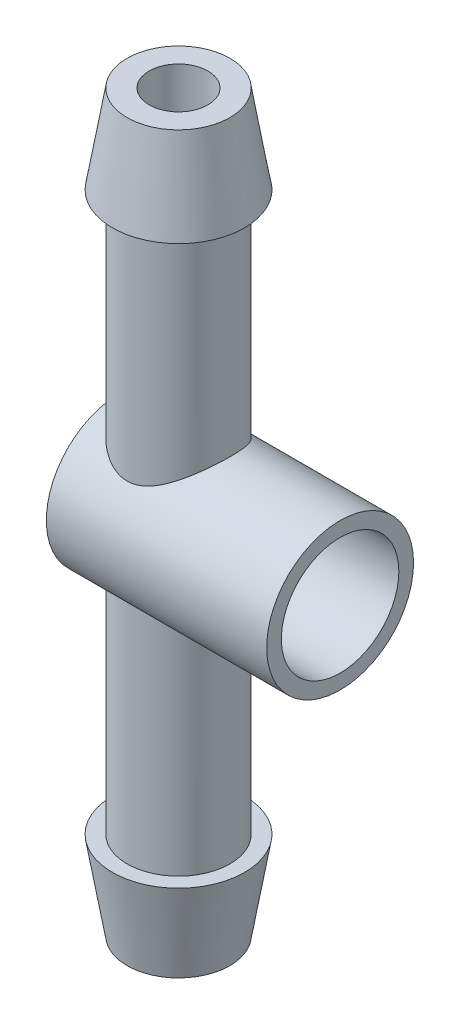
ISO-10303-21;
HEADER;
FILE_DESCRIPTION(('STEP AP214'),'2;1');
FILE_NAME('part.step','',(''),(''),'','','');
FILE_SCHEMA(('AUTOMOTIVE_DESIGN { 1 0 10303 214 1 1 1 1 }'));
ENDSEC;
DATA;
#1=APPLICATION_CONTEXT('core data for automotive mechanical design processes');
#2=APPLICATION_PROTOCOL_DEFINITION('international standard','automotive_design',2000,#1);
#3=PRODUCT_CONTEXT('',#1,'mechanical');
#4=PRODUCT('Part','Part','',(#3));
#5=PRODUCT_RELATED_PRODUCT_CATEGORY('part','',(#4));
#6=PRODUCT_DEFINITION_FORMATION('','',#4);
#7=PRODUCT_DEFINITION_CONTEXT('part definition',#1,'design');
#8=PRODUCT_DEFINITION('design','',#6,#7);
#9=PRODUCT_DEFINITION_SHAPE('','',#8);
#10=(LENGTH_UNIT() NAMED_UNIT(*) SI_UNIT(.MILLI.,.METRE.));
#11=(NAMED_UNIT(*) PLANE_ANGLE_UNIT() SI_UNIT($,.RADIAN.));
#12=(NAMED_UNIT(*) SI_UNIT($,.STERADIAN.) SOLID_ANGLE_UNIT());
#13=UNCERTAINTY_MEASURE_WITH_UNIT(LENGTH_MEASURE(1.E-05),#10,'distance_accuracy_value','');
#14=(GEOMETRIC_REPRESENTATION_CONTEXT(3) GLOBAL_UNCERTAINTY_ASSIGNED_CONTEXT((#13)) GLOBAL_UNIT_ASSIGNED_CONTEXT((#10,
#11,#12)) REPRESENTATION_CONTEXT('',''));
#15=CARTESIAN_POINT('',(0.,0.,0.));
#16=DIRECTION('',(0.,0.,1.));
#17=DIRECTION('',(1.,0.,0.));
#18=AXIS2_PLACEMENT_3D('',#15,#16,#17);
#19=CARTESIAN_POINT('',(0.,0.,0.));
#20=DIRECTION('',(0.,-1.,0.));
#21=DIRECTION('',(0.,0.,-1.));
#22=AXIS2_PLACEMENT_3D('',#19,#20,#21);
#23=CYLINDRICAL_SURFACE('',#22,3.5);
#24=CARTESIAN_POINT('',(0.,19.,0.));
#25=DIRECTION('',(0.,-1.,0.));
#26=DIRECTION('',(0.,0.,-1.));
#27=AXIS2_PLACEMENT_3D('',#24,#25,#26);
#28=CIRCLE('',#27,3.5);
#29=CARTESIAN_POINT('',(0.,19.,-3.5));
#30=VERTEX_POINT('',#29);
#31=EDGE_CURVE('E97',#30,#30,#28,.T.);
#32=ORIENTED_EDGE('',*,*,#31,.T.);
#33=EDGE_LOOP('',(#32));
#34=FACE_BOUND('',#33,.T.);
#35=CARTESIAN_POINT('',(0.,3.57071421427142,-3.5));
#36=CARTESIAN_POINT('',(0.0840116779324864,3.57071444227762,-3.49999986805821));
#37=CARTESIAN_POINT('',(0.168028079140196,3.57369340485415,-3.49696837280135));
#38=CARTESIAN_POINT('',(0.335221129012422,3.58544479584589,-3.48491820858272));
#39=CARTESIAN_POINT('',(0.418397669630142,3.59421796027333,-3.47589877899899));
#40=CARTESIAN_POINT('',(0.583301238778193,3.61712038134413,-3.45205902368666));
#41=CARTESIAN_POINT('',(0.665025625456488,3.63125852486516,-3.43722907172256));
#42=CARTESIAN_POINT('',(0.826329023076986,3.66422903125624,-3.4020589996042));
#43=CARTESIAN_POINT('',(0.905906844242423,3.68306394047143,-3.38171588997806));
#44=CARTESIAN_POINT('',(1.13891610777643,3.74498377926853,-3.31343273469923));
#45=CARTESIAN_POINT('',(1.28866920309647,3.79380187047573,-3.25792983356845));
#46=CARTESIAN_POINT('',(1.5762979964841,3.90087401896263,-3.12892878038648));
#47=CARTESIAN_POINT('',(1.71417286646821,3.95912873329683,-3.05542937508973));
#48=CARTESIAN_POINT('',(2.00068057857175,4.09069829259001,-2.8775800199573));
#49=CARTESIAN_POINT('',(2.14696903211522,4.1648639532264,-2.77008151456322));
#50=CARTESIAN_POINT('',(2.42158246330334,4.31285170621027,-2.533533970982));
#51=CARTESIAN_POINT('',(2.54988496335192,4.38667325913045,-2.40445840102965));
#52=CARTESIAN_POINT('',(2.73702564724301,4.49869833464921,-2.18404386347787));
#53=CARTESIAN_POINT('',(2.80255801089666,4.53894407009186,-2.09934275905102));
#54=CARTESIAN_POINT('',(2.92615122230603,4.61627900113461,-1.92332930388745));
#55=CARTESIAN_POINT('',(2.98421543282749,4.65336961485967,-1.8320199578628));
#56=CARTESIAN_POINT('',(3.09214650586378,4.72331286900139,-1.64329666492626));
#57=CARTESIAN_POINT('',(3.14202401534737,4.75617100167412,-1.5458908781143));
#58=CARTESIAN_POINT('',(3.23289758065904,4.81668778515884,-1.34554036564389));
#59=CARTESIAN_POINT('',(3.27389750364978,4.8443486992323,-1.24259807623482));
#60=CARTESIAN_POINT('',(3.36294664968771,4.90488399105479,-0.983360292526845));
#61=CARTESIAN_POINT('',(3.40555834349915,4.9343004623269,-0.82431114751619));
#62=CARTESIAN_POINT('',(3.46805516224507,4.97763994451799,-0.499863083697432));
#63=CARTESIAN_POINT('',(3.4879584332919,4.9915753260128,-0.334469344205599));
#64=CARTESIAN_POINT('',(3.50396874819295,5.00277536324989,-0.00161744745794356));
#65=CARTESIAN_POINT('',(3.50002957617995,5.00000764195533,0.165844090878665));
#66=CARTESIAN_POINT('',(3.46847694384495,4.9779722699754,0.497418219515082));
#67=CARTESIAN_POINT('',(3.44085688171562,4.95870001812474,0.661529862861085));
#68=CARTESIAN_POINT('',(3.36438776537339,4.90595172527039,0.978182973341564));
#69=CARTESIAN_POINT('',(3.3160375128713,4.87280983262962,1.13090300544785));
#70=CARTESIAN_POINT('',(3.20037374324192,4.79484839778882,1.42573235226602));
#71=CARTESIAN_POINT('',(3.13305650077699,4.75002656164199,1.56783957555516));
#72=CARTESIAN_POINT('',(2.97319649241973,4.64605138757534,1.85472986503378));
#73=CARTESIAN_POINT('',(2.87867047586743,4.58585414417232,1.9980230608955));
#74=CARTESIAN_POINT('',(2.67150358308888,4.45872611615666,2.26760327144735));
#75=CARTESIAN_POINT('',(2.55884319710731,4.39178810890111,2.39387169821936));
#76=CARTESIAN_POINT('',(2.29573767251103,4.24340806485979,2.64933768852684));
#77=CARTESIAN_POINT('',(2.14213778990544,4.16151070369986,2.7750310967952));
#78=CARTESIAN_POINT('',(1.8141470616634,4.00256853562557,2.9997251914824));
#79=CARTESIAN_POINT('',(1.639761605166,3.92552247878181,3.09873277519884));
#80=CARTESIAN_POINT('',(1.31428904519063,3.80266209132211,3.24758768225954));
#81=CARTESIAN_POINT('',(1.16716049925933,3.75374718450966,3.30350993621508));
#82=CARTESIAN_POINT('',(0.862869886422324,3.67060616067577,3.39566741502561));
#83=CARTESIAN_POINT('',(0.70572720470501,3.63635259865795,3.4319394578135));
#84=CARTESIAN_POINT('',(0.464387907698291,3.59988592145285,3.47003079615615));
#85=CARTESIAN_POINT('',(0.382521787369572,3.59020430967993,3.48001777086798));
#86=CARTESIAN_POINT('',(0.217838512660768,3.57641501090518,3.49418953353764));
#87=CARTESIAN_POINT('',(0.135021855389569,3.57230453329973,3.49837722640208));
#88=CARTESIAN_POINT('',(-0.030779718824703,3.56988465651078,3.50084655748581));
#89=CARTESIAN_POINT('',(-0.11376462434785,3.57157487596197,3.49912858397159));
#90=CARTESIAN_POINT('',(-0.279068232542991,3.5806497895567,3.48984003419737));
#91=CARTESIAN_POINT('',(-0.361386963190148,3.58803424331106,3.48226970500183));
#92=CARTESIAN_POINT('',(-0.583474178939261,3.61539718295496,3.4539187383549));
#93=CARTESIAN_POINT('',(-0.721933700488153,3.64061523125558,3.42755118460911));
#94=CARTESIAN_POINT('',(-0.991952802032504,3.70359382721181,3.35939166417161));
#95=CARTESIAN_POINT('',(-1.12350493994883,3.74136759395142,3.31758343584067));
#96=CARTESIAN_POINT('',(-1.43844585408463,3.84548595331839,3.19705702205981));
#97=CARTESIAN_POINT('',(-1.61706048647181,3.91690709544712,3.11022921638748));
#98=CARTESIAN_POINT('',(-1.95485779131787,4.0679911437822,2.90985386221773));
#99=CARTESIAN_POINT('',(-2.11400154770159,4.14766998612658,2.79625408887282));
#100=CARTESIAN_POINT('',(-2.4142081576382,4.30837399504844,2.54184750044465));
#101=CARTESIAN_POINT('',(-2.5548731096704,4.38939619169587,2.40056769357133));
#102=CARTESIAN_POINT('',(-2.81172054695841,4.54370670629866,2.09383690527273));
#103=CARTESIAN_POINT('',(-2.92793893053597,4.61700628432375,1.92842197842841));
#104=CARTESIAN_POINT('',(-3.11554550187088,4.73839524822716,1.60391474590199));
#105=CARTESIAN_POINT('',(-3.19113943423207,4.78864360221706,1.44809589803303));
#106=CARTESIAN_POINT('',(-3.28724745450784,4.85339532505929,1.20483682926395));
#107=CARTESIAN_POINT('',(-3.31640852374087,4.87321301651713,1.12213837140326));
#108=CARTESIAN_POINT('',(-3.36861764851274,4.90889181456439,0.95401795353754));
#109=CARTESIAN_POINT('',(-3.39166831580516,4.92475461141138,0.868597174673483));
#110=CARTESIAN_POINT('',(-3.43145562806069,4.95223988843494,0.695045998305564));
#111=CARTESIAN_POINT('',(-3.44815166702544,4.96383508366238,0.606901942141645));
#112=CARTESIAN_POINT('',(-3.47475258567891,4.98235028019359,0.429146661764379));
#113=CARTESIAN_POINT('',(-3.48466051684761,4.98927238218753,0.339536115360911));
#114=CARTESIAN_POINT('',(-3.49752312855461,4.99826427408952,0.159574638531939));
#115=CARTESIAN_POINT('',(-3.50047838058363,5.00033446281117,0.0692237695715355));
#116=CARTESIAN_POINT('',(-3.49939464155673,4.99957665306816,-0.111386213674409));
#117=CARTESIAN_POINT('',(-3.49535617592889,4.99674902256968,-0.201645334343126));
#118=CARTESIAN_POINT('',(-3.47427171948632,4.98201193742932,-0.453706070640127));
#119=CARTESIAN_POINT('',(-3.44937301889705,4.96462490953326,-0.614624206362604));
#120=CARTESIAN_POINT('',(-3.37825020758882,4.91547827454332,-0.929254385269863));
#121=CARTESIAN_POINT('',(-3.33202204004973,4.88371593331678,-1.08296505147947));
#122=CARTESIAN_POINT('',(-3.21839303684594,4.80689474829355,-1.3852515294605));
#123=CARTESIAN_POINT('',(-3.15030758175346,4.76140930888083,-1.53345914358804));
#124=CARTESIAN_POINT('',(-2.99606380975609,4.6607922006303,-1.81648395037296));
#125=CARTESIAN_POINT('',(-2.90990199689336,4.60565866619876,-1.9512985453851));
#126=CARTESIAN_POINT('',(-2.70695427970237,4.47998570352176,-2.22620599551136));
#127=CARTESIAN_POINT('',(-2.58748644184947,4.40838537577144,-2.36382741622437));
#128=CARTESIAN_POINT('',(-2.32945012816812,4.26203935440107,-2.61851490693396));
#129=CARTESIAN_POINT('',(-2.19084193301166,4.18728735064932,-2.73553705055278));
#130=CARTESIAN_POINT('',(-1.95826810861001,4.07177790192352,-2.90279164002683));
#131=CARTESIAN_POINT('',(-1.87006627480007,4.02995435750541,-2.96040527554756));
#132=CARTESIAN_POINT('',(-1.68799665355905,3.94875555037811,-3.06787708455973));
#133=CARTESIAN_POINT('',(-1.59412727898289,3.90938097980844,-3.11773307147625));
#134=CARTESIAN_POINT('',(-1.30472529929834,3.79747094334634,-3.25469370743702));
#135=CARTESIAN_POINT('',(-1.10068833748911,3.73077213202405,-3.32970789539528));
#136=CARTESIAN_POINT('',(-0.745417198827448,3.64508796183998,-3.42286407941504));
#137=CARTESIAN_POINT('',(-0.599023314935424,3.61761863156992,-3.45160892505021));
#138=CARTESIAN_POINT('',(-0.376071880715412,3.58970095616241,-3.48054616594461));
#139=CARTESIAN_POINT('',(-0.301217998367208,3.58260959032748,-3.48782851362814));
#140=CARTESIAN_POINT('',(-0.150910559292508,3.57311680421739,-3.49755478092014));
#141=CARTESIAN_POINT('',(-0.075457184822403,3.57071400948196,-3.50000011850681));
#142=CARTESIAN_POINT('',(0.,3.57071421427142,-3.5));
#143=B_SPLINE_CURVE_WITH_KNOTS('',3,(#35,#36,#37,#38,#39,#40,#41,#42,#43,#44,#45,#46,#47,#48,
#49,#50,#51,#52,#53,#54,#55,#56,#57,#58,#59,#60,#61,#62,#63,#64,#65,#66,#67,#68,#69,#70,#71,#72,
#73,#74,#75,#76,#77,#78,#79,#80,#81,#82,#83,#84,#85,#86,#87,#88,#89,#90,#91,#92,#93,#94,#95,#96,
#97,#98,#99,#100,#101,#102,#103,#104,#105,#106,#107,#108,#109,#110,#111,#112,#113,#114,#115,
#116,#117,#118,#119,#120,#121,#122,#123,#124,#125,#126,#127,#128,#129,#130,#131,#132,#133,#134,
#135,#136,#137,#138,#139,#140,#141,#142),.UNSPECIFIED.,.T.,.F.,(4,2,2,2,2,2,2,2,2,2,2,2,2,2,2,2,
2,2,2,2,2,2,2,2,2,2,2,2,2,2,2,2,2,2,2,2,2,2,2,2,2,2,2,2,2,2,2,2,2,2,2,2,2,4),(0.,
0.25193786641243,0.503907741551042,0.756296829862754,1.00882304920269,1.50767705491856,
2.00656580985309,2.5928214793311,3.17980340054548,3.52260937165968,3.86526043937807,
4.20746228977043,4.54951477248526,5.04896295082257,5.54801174411968,6.04802819620321,
6.54818408924557,7.03692702754728,7.52576602764989,8.06947174934062,8.61376637205,
9.25526677268928,9.89660120988578,10.3893951008704,10.8812624388974,11.1300434938738,
11.3786998873025,11.6273399331954,11.8759694830138,12.303607248783,12.7316966796847,
13.3614491436806,13.9924404037767,14.6353397124454,15.2772882678786,15.8158328001981,
16.0852507072975,16.3545532714235,16.6255488849345,16.8964225968411,17.1672740429107,
17.4381051411785,17.9269002736073,18.4157884121986,18.9217932383026,19.4278960158289,
20.0131431134067,20.5996234731159,20.939266740836,21.2790055678481,21.9556531766709,
22.4086307865933,22.6349814326881,22.8612657138439),.UNSPECIFIED.);
#144=CARTESIAN_POINT('',(0.,3.57071421427142,-3.5));
#145=VERTEX_POINT('',#144);
#146=EDGE_CURVE('E10',#145,#145,#143,.T.);
#147=ORIENTED_EDGE('',*,*,#146,.F.);
#148=EDGE_LOOP('',(#147));
#149=FACE_BOUND('',#148,.T.);
#150=ADVANCED_FACE('F33',(#34,#149),#23,.T.);
#151=CARTESIAN_POINT('',(0.,19.,0.));
#152=DIRECTION('',(0.,1.,0.));
#153=DIRECTION('',(0.,0.,1.));
#154=AXIS2_PLACEMENT_3D('',#151,#152,#153);
#155=PLANE('',#154);
#156=ORIENTED_EDGE('',*,*,#31,.F.);
#157=EDGE_LOOP('',(#156));
#158=FACE_BOUND('',#157,.T.);
#159=CARTESIAN_POINT('',(0.,19.,0.));
#160=DIRECTION('',(0.,-1.,0.));
#161=DIRECTION('',(0.,0.,-1.));
#162=AXIS2_PLACEMENT_3D('',#159,#160,#161);
#163=CIRCLE('',#162,4.5);
#164=CARTESIAN_POINT('',(0.,19.,-4.5));
#165=VERTEX_POINT('',#164);
#166=EDGE_CURVE('E100',#165,#165,#163,.T.);
#167=ORIENTED_EDGE('',*,*,#166,.T.);
#168=EDGE_LOOP('',(#167));
#169=FACE_BOUND('',#168,.T.);
#170=ADVANCED_FACE('F85',(#158,#169),#155,.F.);
#171=CARTESIAN_POINT('',(0.,25.,0.));
#172=DIRECTION('',(0.,-1.,0.));
#173=DIRECTION('',(0.,0.,-1.));
#174=AXIS2_PLACEMENT_3D('',#171,#172,#173);
#175=CONICAL_SURFACE('',#174,3.5,0.165148677414627);
#176=ORIENTED_EDGE('',*,*,#166,.F.);
#177=EDGE_LOOP('',(#176));
#178=FACE_BOUND('',#177,.T.);
#179=CARTESIAN_POINT('',(0.,25.,0.));
#180=DIRECTION('',(0.,-1.,0.));
#181=DIRECTION('',(0.,0.,-1.));
#182=AXIS2_PLACEMENT_3D('',#179,#180,#181);
#183=CIRCLE('',#182,3.5);
#184=CARTESIAN_POINT('',(0.,25.,-3.5));
#185=VERTEX_POINT('',#184);
#186=EDGE_CURVE('E101',#185,#185,#183,.T.);
#187=ORIENTED_EDGE('',*,*,#186,.T.);
#188=EDGE_LOOP('',(#187));
#189=FACE_BOUND('',#188,.T.);
#190=ADVANCED_FACE('F82',(#178,#189),#175,.T.);
#191=CARTESIAN_POINT('',(0.,25.,0.));
#192=DIRECTION('',(0.,-1.,0.));
#193=DIRECTION('',(0.,0.,-1.));
#194=AXIS2_PLACEMENT_3D('',#191,#192,#193);
#195=PLANE('',#194);
#196=CARTESIAN_POINT('',(0.,25.,0.));
#197=DIRECTION('',(0.,-1.,0.));
#198=DIRECTION('',(0.,0.,-1.));
#199=AXIS2_PLACEMENT_3D('',#196,#197,#198);
#200=CIRCLE('',#199,2.);
#201=CARTESIAN_POINT('',(0.,25.,-2.));
#202=VERTEX_POINT('',#201);
#203=EDGE_CURVE('E138',#202,#202,#200,.F.);
#204=ORIENTED_EDGE('',*,*,#203,.F.);
#205=EDGE_LOOP('',(#204));
#206=FACE_BOUND('',#205,.T.);
#207=ORIENTED_EDGE('',*,*,#186,.F.);
#208=EDGE_LOOP('',(#207));
#209=FACE_BOUND('',#208,.T.);
#210=ADVANCED_FACE('F75',(#206,#209),#195,.F.);
#211=CARTESIAN_POINT('',(11.,0.,0.));
#212=DIRECTION('',(-1.,0.,0.));
#213=DIRECTION('',(0.,0.,1.));
#214=AXIS2_PLACEMENT_3D('',#211,#212,#213);
#215=CYLINDRICAL_SURFACE('',#214,5.);
#216=CARTESIAN_POINT('',(0.,-3.57071421427142,-3.5));
#217=CARTESIAN_POINT('',(-0.0840116779324864,-3.57071444227762,-3.49999986805821));
#218=CARTESIAN_POINT('',(-0.168028079140196,-3.57369340485415,-3.49696837280135));
#219=CARTESIAN_POINT('',(-0.335221129012422,-3.58544479584589,-3.48491820858272));
#220=CARTESIAN_POINT('',(-0.418397669630142,-3.59421796027333,-3.47589877899899));
#221=CARTESIAN_POINT('',(-0.583301238778193,-3.61712038134413,-3.45205902368666));
#222=CARTESIAN_POINT('',(-0.665025625456488,-3.63125852486516,-3.43722907172256));
#223=CARTESIAN_POINT('',(-0.826329023076986,-3.66422903125624,-3.4020589996042));
#224=CARTESIAN_POINT('',(-0.905906844242423,-3.68306394047143,-3.38171588997806));
#225=CARTESIAN_POINT('',(-1.13891610777643,-3.74498377926853,-3.31343273469923));
#226=CARTESIAN_POINT('',(-1.28866920309647,-3.79380187047573,-3.25792983356845));
#227=CARTESIAN_POINT('',(-1.5762979964841,-3.90087401896263,-3.12892878038648));
#228=CARTESIAN_POINT('',(-1.71417286646821,-3.95912873329683,-3.05542937508973));
#229=CARTESIAN_POINT('',(-2.00068057857175,-4.09069829259001,-2.8775800199573));
#230=CARTESIAN_POINT('',(-2.14696903211522,-4.1648639532264,-2.77008151456322));
#231=CARTESIAN_POINT('',(-2.42158246330334,-4.31285170621027,-2.533533970982));
#232=CARTESIAN_POINT('',(-2.54988496335192,-4.38667325913045,-2.40445840102965));
#233=CARTESIAN_POINT('',(-2.73702564724301,-4.49869833464921,-2.18404386347787));
#234=CARTESIAN_POINT('',(-2.80255801089666,-4.53894407009186,-2.09934275905102));
#235=CARTESIAN_POINT('',(-2.92615122230603,-4.61627900113461,-1.92332930388745));
#236=CARTESIAN_POINT('',(-2.98421543282749,-4.65336961485967,-1.8320199578628));
#237=CARTESIAN_POINT('',(-3.09214650586378,-4.72331286900139,-1.64329666492626));
#238=CARTESIAN_POINT('',(-3.14202401534737,-4.75617100167412,-1.5458908781143));
#239=CARTESIAN_POINT('',(-3.23289758065904,-4.81668778515884,-1.34554036564389));
#240=CARTESIAN_POINT('',(-3.27389750364978,-4.8443486992323,-1.24259807623482));
#241=CARTESIAN_POINT('',(-3.36294664968771,-4.90488399105479,-0.983360292526845));
#242=CARTESIAN_POINT('',(-3.40555834349915,-4.9343004623269,-0.82431114751619));
#243=CARTESIAN_POINT('',(-3.46805516224507,-4.97763994451799,-0.499863083697432));
#244=CARTESIAN_POINT('',(-3.4879584332919,-4.9915753260128,-0.334469344205599));
#245=CARTESIAN_POINT('',(-3.50396874819295,-5.00277536324989,-0.00161744745794356));
#246=CARTESIAN_POINT('',(-3.50002957617995,-5.00000764195533,0.165844090878665));
#247=CARTESIAN_POINT('',(-3.46847694384495,-4.9779722699754,0.497418219515082));
#248=CARTESIAN_POINT('',(-3.44085688171562,-4.95870001812474,0.661529862861085));
#249=CARTESIAN_POINT('',(-3.36438776537339,-4.90595172527039,0.978182973341564));
#250=CARTESIAN_POINT('',(-3.3160375128713,-4.87280983262962,1.13090300544785));
#251=CARTESIAN_POINT('',(-3.20037374324192,-4.79484839778882,1.42573235226602));
#252=CARTESIAN_POINT('',(-3.13305650077699,-4.75002656164199,1.56783957555516));
#253=CARTESIAN_POINT('',(-2.97319649241973,-4.64605138757534,1.85472986503378));
#254=CARTESIAN_POINT('',(-2.87867047586743,-4.58585414417232,1.9980230608955));
#255=CARTESIAN_POINT('',(-2.67150358308888,-4.45872611615666,2.26760327144735));
#256=CARTESIAN_POINT('',(-2.55884319710731,-4.39178810890111,2.39387169821936));
#257=CARTESIAN_POINT('',(-2.29573767251103,-4.24340806485979,2.64933768852684));
#258=CARTESIAN_POINT('',(-2.14213778990544,-4.16151070369986,2.7750310967952));
#259=CARTESIAN_POINT('',(-1.8141470616634,-4.00256853562557,2.9997251914824));
#260=CARTESIAN_POINT('',(-1.639761605166,-3.92552247878181,3.09873277519884));
#261=CARTESIAN_POINT('',(-1.31428904519063,-3.80266209132211,3.24758768225954));
#262=CARTESIAN_POINT('',(-1.16716049925933,-3.75374718450966,3.30350993621508));
#263=CARTESIAN_POINT('',(-0.862869886422324,-3.67060616067577,3.39566741502561));
#264=CARTESIAN_POINT('',(-0.70572720470501,-3.63635259865795,3.4319394578135));
#265=CARTESIAN_POINT('',(-0.464387907698291,-3.59988592145285,3.47003079615615));
#266=CARTESIAN_POINT('',(-0.382521787369572,-3.59020430967993,3.48001777086798));
#267=CARTESIAN_POINT('',(-0.217838512660768,-3.57641501090518,3.49418953353764));
#268=CARTESIAN_POINT('',(-0.135021855389569,-3.57230453329973,3.49837722640208));
#269=CARTESIAN_POINT('',(0.030779718824703,-3.56988465651078,3.50084655748581));
#270=CARTESIAN_POINT('',(0.11376462434785,-3.57157487596197,3.49912858397159));
#271=CARTESIAN_POINT('',(0.279068232542991,-3.5806497895567,3.48984003419737));
#272=CARTESIAN_POINT('',(0.361386963190148,-3.58803424331106,3.48226970500183));
#273=CARTESIAN_POINT('',(0.583474178939261,-3.61539718295496,3.4539187383549));
#274=CARTESIAN_POINT('',(0.721933700488153,-3.64061523125558,3.42755118460911));
#275=CARTESIAN_POINT('',(0.991952802032504,-3.70359382721181,3.35939166417161));
#276=CARTESIAN_POINT('',(1.12350493994883,-3.74136759395142,3.31758343584067));
#277=CARTESIAN_POINT('',(1.43844585408463,-3.84548595331839,3.19705702205981));
#278=CARTESIAN_POINT('',(1.61706048647181,-3.91690709544712,3.11022921638748));
#279=CARTESIAN_POINT('',(1.95485779131787,-4.0679911437822,2.90985386221773));
#280=CARTESIAN_POINT('',(2.11400154770159,-4.14766998612658,2.79625408887282));
#281=CARTESIAN_POINT('',(2.4142081576382,-4.30837399504844,2.54184750044465));
#282=CARTESIAN_POINT('',(2.5548731096704,-4.38939619169587,2.40056769357133));
#283=CARTESIAN_POINT('',(2.81172054695841,-4.54370670629866,2.09383690527273));
#284=CARTESIAN_POINT('',(2.92793893053597,-4.61700628432375,1.92842197842841));
#285=CARTESIAN_POINT('',(3.11554550187088,-4.73839524822716,1.60391474590199));
#286=CARTESIAN_POINT('',(3.19113943423207,-4.78864360221706,1.44809589803303));
#287=CARTESIAN_POINT('',(3.28724745450784,-4.85339532505929,1.20483682926395));
#288=CARTESIAN_POINT('',(3.31640852374087,-4.87321301651713,1.12213837140326));
#289=CARTESIAN_POINT('',(3.36861764851274,-4.90889181456439,0.95401795353754));
#290=CARTESIAN_POINT('',(3.39166831580516,-4.92475461141138,0.868597174673483));
#291=CARTESIAN_POINT('',(3.43145562806069,-4.95223988843494,0.695045998305564));
#292=CARTESIAN_POINT('',(3.44815166702544,-4.96383508366238,0.606901942141645));
#293=CARTESIAN_POINT('',(3.47475258567891,-4.98235028019359,0.429146661764379));
#294=CARTESIAN_POINT('',(3.48466051684761,-4.98927238218753,0.339536115360911));
#295=CARTESIAN_POINT('',(3.49752312855461,-4.99826427408952,0.159574638531939));
#296=CARTESIAN_POINT('',(3.50047838058363,-5.00033446281117,0.0692237695715355));
#297=CARTESIAN_POINT('',(3.49939464155673,-4.99957665306816,-0.111386213674409));
#298=CARTESIAN_POINT('',(3.49535617592889,-4.99674902256968,-0.201645334343126));
#299=CARTESIAN_POINT('',(3.47427171948632,-4.98201193742932,-0.453706070640127));
#300=CARTESIAN_POINT('',(3.44937301889705,-4.96462490953326,-0.614624206362604));
#301=CARTESIAN_POINT('',(3.37825020758882,-4.91547827454332,-0.929254385269863));
#302=CARTESIAN_POINT('',(3.33202204004973,-4.88371593331678,-1.08296505147947));
#303=CARTESIAN_POINT('',(3.21839303684594,-4.80689474829355,-1.3852515294605));
#304=CARTESIAN_POINT('',(3.15030758175346,-4.76140930888083,-1.53345914358804));
#305=CARTESIAN_POINT('',(2.99606380975609,-4.6607922006303,-1.81648395037296));
#306=CARTESIAN_POINT('',(2.90990199689336,-4.60565866619876,-1.9512985453851));
#307=CARTESIAN_POINT('',(2.70695427970237,-4.47998570352176,-2.22620599551136));
#308=CARTESIAN_POINT('',(2.58748644184947,-4.40838537577144,-2.36382741622437));
#309=CARTESIAN_POINT('',(2.32945012816812,-4.26203935440107,-2.61851490693396));
#310=CARTESIAN_POINT('',(2.19084193301166,-4.18728735064932,-2.73553705055278));
#311=CARTESIAN_POINT('',(1.95826810861001,-4.07177790192352,-2.90279164002683));
#312=CARTESIAN_POINT('',(1.87006627480007,-4.02995435750541,-2.96040527554756));
#313=CARTESIAN_POINT('',(1.68799665355905,-3.94875555037811,-3.06787708455973));
#314=CARTESIAN_POINT('',(1.59412727898289,-3.90938097980844,-3.11773307147625));
#315=CARTESIAN_POINT('',(1.30472529929834,-3.79747094334634,-3.25469370743702));
#316=CARTESIAN_POINT('',(1.10068833748911,-3.73077213202405,-3.32970789539528));
#317=CARTESIAN_POINT('',(0.745417198827448,-3.64508796183998,-3.42286407941504));
#318=CARTESIAN_POINT('',(0.599023314935424,-3.61761863156992,-3.45160892505021));
#319=CARTESIAN_POINT('',(0.376071880715412,-3.58970095616241,-3.48054616594461));
#320=CARTESIAN_POINT('',(0.301217998367208,-3.58260959032748,-3.48782851362814));
#321=CARTESIAN_POINT('',(0.150910559292508,-3.57311680421739,-3.49755478092014));
#322=CARTESIAN_POINT('',(0.075457184822403,-3.57071400948196,-3.50000011850681));
#323=CARTESIAN_POINT('',(0.,-3.57071421427142,-3.5));
#324=B_SPLINE_CURVE_WITH_KNOTS('',3,(#216,#217,#218,#219,#220,#221,#222,#223,#224,#225,#226,
#227,#228,#229,#230,#231,#232,#233,#234,#235,#236,#237,#238,#239,#240,#241,#242,#243,#244,#245,
#246,#247,#248,#249,#250,#251,#252,#253,#254,#255,#256,#257,#258,#259,#260,#261,#262,#263,#264,
#265,#266,#267,#268,#269,#270,#271,#272,#273,#274,#275,#276,#277,#278,#279,#280,#281,#282,#283,
#284,#285,#286,#287,#288,#289,#290,#291,#292,#293,#294,#295,#296,#297,#298,#299,#300,#301,#302,
#303,#304,#305,#306,#307,#308,#309,#310,#311,#312,#313,#314,#315,#316,#317,#318,#319,#320,#321,
#322,#323),.UNSPECIFIED.,.T.,.F.,(4,2,2,2,2,2,2,2,2,2,2,2,2,2,2,2,2,2,2,2,2,2,2,2,2,2,2,2,2,2,2,
2,2,2,2,2,2,2,2,2,2,2,2,2,2,2,2,2,2,2,2,2,2,4),(0.,0.25193786641243,0.503907741551042,
0.756296829862754,1.00882304920269,1.50767705491856,2.00656580985309,2.5928214793311,
3.17980340054548,3.52260937165968,3.86526043937807,4.20746228977043,4.54951477248526,
5.04896295082257,5.54801174411968,6.04802819620321,6.54818408924557,7.03692702754728,
7.52576602764989,8.06947174934062,8.61376637205,9.25526677268928,9.89660120988578,
10.3893951008704,10.8812624388974,11.1300434938738,11.3786998873025,11.6273399331954,
11.8759694830138,12.303607248783,12.7316966796847,13.3614491436806,13.9924404037767,
14.6353397124454,15.2772882678786,15.8158328001981,16.0852507072975,16.3545532714235,
16.6255488849345,16.8964225968411,17.1672740429107,17.4381051411785,17.9269002736073,
18.4157884121986,18.9217932383026,19.4278960158289,20.0131431134067,20.5996234731159,
20.939266740836,21.2790055678481,21.9556531766709,22.4086307865933,22.6349814326881,
22.8612657138439),.UNSPECIFIED.);
#325=CARTESIAN_POINT('',(0.,-3.57071421427142,-3.5));
#326=VERTEX_POINT('',#325);
#327=EDGE_CURVE('E46',#326,#326,#324,.T.);
#328=ORIENTED_EDGE('',*,*,#327,.T.);
#329=EDGE_LOOP('',(#328));
#330=FACE_BOUND('',#329,.T.);
#331=CARTESIAN_POINT('',(11.,0.,0.));
#332=DIRECTION('',(1.,0.,0.));
#333=DIRECTION('',(0.,0.,-1.));
#334=AXIS2_PLACEMENT_3D('',#331,#332,#333);
#335=CIRCLE('',#334,5.);
#336=CARTESIAN_POINT('',(11.,0.,-5.));
#337=VERTEX_POINT('',#336);
#338=EDGE_CURVE('E106',#337,#337,#335,.T.);
#339=ORIENTED_EDGE('',*,*,#338,.F.);
#340=EDGE_LOOP('',(#339));
#341=FACE_BOUND('',#340,.T.);
#342=CARTESIAN_POINT('',(-4.,0.,0.));
#343=DIRECTION('',(1.,0.,0.));
#344=DIRECTION('',(0.,0.,-1.));
#345=AXIS2_PLACEMENT_3D('',#342,#343,#344);
#346=CIRCLE('',#345,5.);
#347=CARTESIAN_POINT('',(-4.,0.,-5.));
#348=VERTEX_POINT('',#347);
#349=EDGE_CURVE('E146',#348,#348,#346,.T.);
#350=ORIENTED_EDGE('',*,*,#349,.T.);
#351=EDGE_LOOP('',(#350));
#352=FACE_BOUND('',#351,.T.);
#353=ORIENTED_EDGE('',*,*,#146,.T.);
#354=EDGE_LOOP('',(#353));
#355=FACE_BOUND('',#354,.T.);
#356=ADVANCED_FACE('F69',(#330,#341,#352,#355),#215,.T.);
#357=CARTESIAN_POINT('',(11.,0.,0.));
#358=DIRECTION('',(1.,0.,0.));
#359=DIRECTION('',(0.,0.,-1.));
#360=AXIS2_PLACEMENT_3D('',#357,#358,#359);
#361=PLANE('',#360);
#362=CARTESIAN_POINT('',(11.,0.,0.));
#363=DIRECTION('',(1.,0.,0.));
#364=DIRECTION('',(0.,0.,-1.));
#365=AXIS2_PLACEMENT_3D('',#362,#363,#364);
#366=CIRCLE('',#365,4.);
#367=CARTESIAN_POINT('',(11.,0.,-4.));
#368=VERTEX_POINT('',#367);
#369=EDGE_CURVE('E147',#368,#368,#366,.T.);
#370=ORIENTED_EDGE('',*,*,#369,.F.);
#371=EDGE_LOOP('',(#370));
#372=FACE_BOUND('',#371,.T.);
#373=ORIENTED_EDGE('',*,*,#338,.T.);
#374=EDGE_LOOP('',(#373));
#375=FACE_BOUND('',#374,.T.);
#376=ADVANCED_FACE('F74',(#372,#375),#361,.T.);
#377=CARTESIAN_POINT('',(-4.,0.,0.));
#378=DIRECTION('',(1.,0.,0.));
#379=DIRECTION('',(0.,0.,-1.));
#380=AXIS2_PLACEMENT_3D('',#377,#378,#379);
#381=PLANE('',#380);
#382=ORIENTED_EDGE('',*,*,#349,.F.);
#383=EDGE_LOOP('',(#382));
#384=FACE_BOUND('',#383,.T.);
#385=ADVANCED_FACE('F77',(#384),#381,.F.);
#386=CARTESIAN_POINT('',(0.,-25.,0.));
#387=DIRECTION('',(0.,-1.,0.));
#388=DIRECTION('',(0.,0.,-1.));
#389=AXIS2_PLACEMENT_3D('',#386,#387,#388);
#390=PLANE('',#389);
#391=CARTESIAN_POINT('',(0.,-25.,0.));
#392=DIRECTION('',(0.,-1.,0.));
#393=DIRECTION('',(0.,0.,-1.));
#394=AXIS2_PLACEMENT_3D('',#391,#392,#393);
#395=CIRCLE('',#394,2.);
#396=CARTESIAN_POINT('',(0.,-25.,-2.));
#397=VERTEX_POINT('',#396);
#398=EDGE_CURVE('E136',#397,#397,#395,.T.);
#399=ORIENTED_EDGE('',*,*,#398,.F.);
#400=EDGE_LOOP('',(#399));
#401=FACE_BOUND('',#400,.T.);
#402=CARTESIAN_POINT('',(0.,-25.,0.));
#403=DIRECTION('',(0.,-1.,0.));
#404=DIRECTION('',(0.,0.,-1.));
#405=AXIS2_PLACEMENT_3D('',#402,#403,#404);
#406=CIRCLE('',#405,3.50000000000001);
#407=CARTESIAN_POINT('',(0.,-25.,-3.50000000000001));
#408=VERTEX_POINT('',#407);
#409=EDGE_CURVE('E51',#408,#408,#406,.T.);
#410=ORIENTED_EDGE('',*,*,#409,.T.);
#411=EDGE_LOOP('',(#410));
#412=FACE_BOUND('',#411,.T.);
#413=ADVANCED_FACE('F35',(#401,#412),#390,.T.);
#414=CARTESIAN_POINT('',(0.,-25.,0.));
#415=DIRECTION('',(0.,1.,0.));
#416=DIRECTION('',(0.,0.,1.));
#417=AXIS2_PLACEMENT_3D('',#414,#415,#416);
#418=CONICAL_SURFACE('',#417,3.50000000000001,0.165148677414627);
#419=CARTESIAN_POINT('',(0.,-19.,0.));
#420=DIRECTION('',(0.,-1.,0.));
#421=DIRECTION('',(0.,0.,-1.));
#422=AXIS2_PLACEMENT_3D('',#419,#420,#421);
#423=CIRCLE('',#422,4.50000000000001);
#424=CARTESIAN_POINT('',(0.,-19.,-4.50000000000001));
#425=VERTEX_POINT('',#424);
#426=EDGE_CURVE('E112',#425,#425,#423,.T.);
#427=ORIENTED_EDGE('',*,*,#426,.T.);
#428=EDGE_LOOP('',(#427));
#429=FACE_BOUND('',#428,.T.);
#430=ORIENTED_EDGE('',*,*,#409,.F.);
#431=EDGE_LOOP('',(#430));
#432=FACE_BOUND('',#431,.T.);
#433=ADVANCED_FACE('F118',(#429,#432),#418,.T.);
#434=CARTESIAN_POINT('',(0.,-19.,0.));
#435=DIRECTION('',(0.,1.,0.));
#436=DIRECTION('',(0.,0.,1.));
#437=AXIS2_PLACEMENT_3D('',#434,#435,#436);
#438=PLANE('',#437);
#439=CARTESIAN_POINT('',(0.,-19.,0.));
#440=DIRECTION('',(0.,-1.,0.));
#441=DIRECTION('',(0.,0.,-1.));
#442=AXIS2_PLACEMENT_3D('',#439,#440,#441);
#443=CIRCLE('',#442,3.5);
#444=CARTESIAN_POINT('',(0.,-19.,-3.5));
#445=VERTEX_POINT('',#444);
#446=EDGE_CURVE('E103',#445,#445,#443,.T.);
#447=ORIENTED_EDGE('',*,*,#446,.T.);
#448=EDGE_LOOP('',(#447));
#449=FACE_BOUND('',#448,.T.);
#450=ORIENTED_EDGE('',*,*,#426,.F.);
#451=EDGE_LOOP('',(#450));
#452=FACE_BOUND('',#451,.T.);
#453=ADVANCED_FACE('F120',(#449,#452),#438,.T.);
#454=ORIENTED_EDGE('',*,*,#446,.F.);
#455=EDGE_LOOP('',(#454));
#456=FACE_BOUND('',#455,.T.);
#457=ORIENTED_EDGE('',*,*,#327,.F.);
#458=EDGE_LOOP('',(#457));
#459=FACE_BOUND('',#458,.T.);
#460=ADVANCED_FACE('F93',(#456,#459),#23,.T.);
#461=CARTESIAN_POINT('',(-2.5,0.,0.));
#462=DIRECTION('',(1.,0.,0.));
#463=DIRECTION('',(0.,0.,-1.));
#464=AXIS2_PLACEMENT_3D('',#461,#462,#463);
#465=CYLINDRICAL_SURFACE('',#464,4.);
#466=CARTESIAN_POINT('',(0.,3.46410161513775,-2.));
#467=CARTESIAN_POINT('',(-0.104213205474344,3.46411185715888,-1.99999158748781));
#468=CARTESIAN_POINT('',(-0.208562176533799,3.46887633544978,-1.99179963610437));
#469=CARTESIAN_POINT('',(-0.414055177230601,3.48724701669072,-1.95944672580053));
#470=CARTESIAN_POINT('',(-0.515192003247761,3.50087179788183,-1.93525221095662));
#471=CARTESIAN_POINT('',(-0.710903156446934,3.53498701490002,-1.8721998159803));
#472=CARTESIAN_POINT('',(-0.805509258849251,3.55544089069169,-1.83341988295963));
#473=CARTESIAN_POINT('',(-0.986848450476154,3.60085327291133,-1.74253507245138));
#474=CARTESIAN_POINT('',(-1.07358111343677,3.62581202301253,-1.69042947410139));
#475=CARTESIAN_POINT('',(-1.24461144313338,3.67993738819289,-1.569333074538));
#476=CARTESIAN_POINT('',(-1.32811826759177,3.70928127465103,-1.49930407053533));
#477=CARTESIAN_POINT('',(-1.4828167805706,3.76743965382121,-1.34650761698202));
#478=CARTESIAN_POINT('',(-1.55400232620397,3.79625387610258,-1.26373385204841));
#479=CARTESIAN_POINT('',(-1.6867343011885,3.85242953961661,-1.08097912631265));
#480=CARTESIAN_POINT('',(-1.74730753542331,3.87956212851245,-0.980214377887153));
#481=CARTESIAN_POINT('',(-1.85028170678709,3.92701512184167,-0.768314053336917));
#482=CARTESIAN_POINT('',(-1.8926941123508,3.94733982363631,-0.657185076311985));
#483=CARTESIAN_POINT('',(-1.95500932253118,3.97760922492053,-0.436089887818817));
#484=CARTESIAN_POINT('',(-1.9762990526921,3.9881896044274,-0.326603580968785));
#485=CARTESIAN_POINT('',(-2.00033223736903,4.00015167691179,-0.10514125740454));
#486=CARTESIAN_POINT('',(-2.00308691359628,4.00153893568935,0.00683321168520786));
#487=CARTESIAN_POINT('',(-1.99050665205486,3.99525963833124,0.219665048849573));
#488=CARTESIAN_POINT('',(-1.97672396895636,3.98836991784381,0.320642398354139));
#489=CARTESIAN_POINT('',(-1.93423831219188,3.96748490519435,0.518627543836089));
#490=CARTESIAN_POINT('',(-1.90553422204788,3.95348908132771,0.615635042187702));
#491=CARTESIAN_POINT('',(-1.83383486782005,3.91943166575325,0.80461878313926));
#492=CARTESIAN_POINT('',(-1.79064737365578,3.89928883058403,0.896506847030398));
#493=CARTESIAN_POINT('',(-1.6914731675971,3.8547529197337,1.07195360302662));
#494=CARTESIAN_POINT('',(-1.63548187339532,3.83035832314967,1.15550929767728));
#495=CARTESIAN_POINT('',(-1.50620929693394,3.7768878879846,1.3203473217964));
#496=CARTESIAN_POINT('',(-1.43179394334797,3.7475875199635,1.40066815005873));
#497=CARTESIAN_POINT('',(-1.27082055013965,3.68908681173623,1.54820874059556));
#498=CARTESIAN_POINT('',(-1.18425325545188,3.65988656531257,1.61541842314846));
#499=CARTESIAN_POINT('',(-0.994703615151822,3.60288312184969,1.73901066928442));
#500=CARTESIAN_POINT('',(-0.891027953891577,3.57528639981415,1.7944346299561));
#501=CARTESIAN_POINT('',(-0.674124657282003,3.52750900557152,1.88663822600246));
#502=CARTESIAN_POINT('',(-0.560907133964873,3.50732060092135,1.92343731642178));
#503=CARTESIAN_POINT('',(-0.337570977434419,3.47889271634069,1.97436042205008));
#504=CARTESIAN_POINT('',(-0.227917761912901,3.46983311696993,1.99005024423995));
#505=CARTESIAN_POINT('',(-0.00719731696690888,3.46235838723219,2.00303389322285));
#506=CARTESIAN_POINT('',(0.103868858239598,3.46393573778623,2.00034071463005));
#507=CARTESIAN_POINT('',(0.311307837157438,3.4766867308117,1.97807208668793));
#508=CARTESIAN_POINT('',(0.407958902215785,3.48679175013308,1.96037563342492));
#509=CARTESIAN_POINT('',(0.596735572541989,3.51388043102682,1.91139256926489));
#510=CARTESIAN_POINT('',(0.688859701493482,3.53086632010068,1.88010155724727));
#511=CARTESIAN_POINT('',(0.870822661805116,3.57072444159313,1.80329517720973));
#512=CARTESIAN_POINT('',(0.960358033706051,3.59383286486126,1.7571881273853));
#513=CARTESIAN_POINT('',(1.13093854307904,3.643122389945,1.65257412803176));
#514=CARTESIAN_POINT('',(1.21197928703051,3.66930506710298,1.59406080866498));
#515=CARTESIAN_POINT('',(1.37395753504266,3.72575996912669,1.45767433439708));
#516=CARTESIAN_POINT('',(1.45359430141778,3.75613166308566,1.37829054462748));
#517=CARTESIAN_POINT('',(1.59882447600473,3.81468469955797,1.20680899079904));
#518=CARTESIAN_POINT('',(1.66441314052684,3.84286530015463,1.11470694931991));
#519=CARTESIAN_POINT('',(1.78114745183271,3.89482723381868,0.917070725108058));
#520=CARTESIAN_POINT('',(1.83186623616677,3.91847283343884,0.811246195112494));
#521=CARTESIAN_POINT('',(1.91427580796961,3.95766709918776,0.591044729317865));
#522=CARTESIAN_POINT('',(1.9459833036841,3.97322287353397,0.476675402917652));
#523=CARTESIAN_POINT('',(1.98673712748514,3.99335016363174,0.253959364539763));
#524=CARTESIAN_POINT('',(1.99759574866428,3.9987985581427,0.146022887268299));
#525=CARTESIAN_POINT('',(2.00168653399567,4.00084260752374,-0.0702519714699466));
#526=CARTESIAN_POINT('',(1.99492486852887,3.99744136141634,-0.178590198981615));
#527=CARTESIAN_POINT('',(1.9651671756836,3.98267937668509,-0.38507598613686));
#528=CARTESIAN_POINT('',(1.94327026269095,3.97185789309443,-0.483424641057419));
#529=CARTESIAN_POINT('',(1.88534604019333,3.94384187353387,-0.674891898931565));
#530=CARTESIAN_POINT('',(1.84931670429309,3.92664642364424,-0.768009749669773));
#531=CARTESIAN_POINT('',(1.7625457450086,3.8865186139318,-0.950846833596741));
#532=CARTESIAN_POINT('',(1.71124078024814,3.86337234005404,-1.0402503657229));
#533=CARTESIAN_POINT('',(1.59608471188191,3.81376266676027,-1.20954920326828));
#534=CARTESIAN_POINT('',(1.53222784589843,3.78729774583427,-1.28944011444319));
#535=CARTESIAN_POINT('',(1.38640336444059,3.73057218840582,-1.44582833859495));
#536=CARTESIAN_POINT('',(1.30326581919971,3.70019591726075,-1.52119665879199));
#537=CARTESIAN_POINT('',(1.12510777169391,3.64126158628571,-1.65732528394006));
#538=CARTESIAN_POINT('',(1.03007686863948,3.61270515130784,-1.71807266521244));
#539=CARTESIAN_POINT('',(0.826691105869755,3.55999186256751,-1.82486714716811));
#540=CARTESIAN_POINT('',(0.718010089264727,3.53600256268535,-1.87038902381914));
#541=CARTESIAN_POINT('',(0.549421880369055,3.5069621813237,-1.92395929504801));
#542=CARTESIAN_POINT('',(0.492352179409321,3.49844389329401,-1.93935666147967));
#543=CARTESIAN_POINT('',(0.376767442499811,3.48406059323535,-1.96508069805043));
#544=CARTESIAN_POINT('',(0.318253447245748,3.47819372636051,-1.97541091343282));
#545=CARTESIAN_POINT('',(0.21639921075271,3.47059023668758,-1.9887293296122));
#546=CARTESIAN_POINT('',(0.173266942749926,3.46816389731816,-1.99295091983786));
#547=CARTESIAN_POINT('',(0.0867643069071045,3.46491740045177,-1.99858810035606));
#548=CARTESIAN_POINT('',(0.0433939233333004,3.46409735040492,-2.00000350293331));
#549=CARTESIAN_POINT('',(0.,3.46410161513775,-2.));
#550=B_SPLINE_CURVE_WITH_KNOTS('',3,(#466,#467,#468,#469,#470,#471,#472,#473,#474,#475,#476,
#477,#478,#479,#480,#481,#482,#483,#484,#485,#486,#487,#488,#489,#490,#491,#492,#493,#494,#495,
#496,#497,#498,#499,#500,#501,#502,#503,#504,#505,#506,#507,#508,#509,#510,#511,#512,#513,#514,
#515,#516,#517,#518,#519,#520,#521,#522,#523,#524,#525,#526,#527,#528,#529,#530,#531,#532,#533,
#534,#535,#536,#537,#538,#539,#540,#541,#542,#543,#544,#545,#546,#547,#548,#549),.UNSPECIFIED.,
.T.,.F.,(4,2,2,2,2,2,2,2,2,2,2,2,2,2,2,2,2,2,2,2,2,2,2,2,2,2,2,2,2,2,2,2,2,2,2,2,2,2,2,2,2,4),
(0.,0.312464245189431,0.62558578564961,0.937057191861536,1.24854545093097,1.58572462503713,
1.92307142172809,2.28315784481594,2.64301653931849,2.97726969939937,3.31132047376147,
3.61632194973143,3.92134625038977,4.2305906946636,4.5399459870461,4.87854382917848,
5.21740096495904,5.57777683462963,5.93777548427476,6.2692458171249,6.60048186380813,
6.89548366852118,7.19058104876193,7.49934592816242,7.80826972444161,8.15613487165293,
8.50411729960471,8.86128362829998,9.2181355962161,9.5422454078304,9.8662417359201,
10.1688884974705,10.4715786702809,10.7872150144301,11.1029966020551,11.450204837042,
11.7977188569438,12.1562149808128,12.3351395323571,12.5139387197526,12.6440387634036,
12.7741475095882),.UNSPECIFIED.);
#551=CARTESIAN_POINT('',(0.,3.46410161513775,-2.));
#552=VERTEX_POINT('',#551);
#553=EDGE_CURVE('E37',#552,#552,#550,.T.);
#554=ORIENTED_EDGE('',*,*,#553,.T.);
#555=EDGE_LOOP('',(#554));
#556=FACE_BOUND('',#555,.T.);
#557=CARTESIAN_POINT('',(0.,-3.46410161513775,-2.));
#558=CARTESIAN_POINT('',(0.104213205474344,-3.46411185715888,-1.99999158748781));
#559=CARTESIAN_POINT('',(0.208562176533799,-3.46887633544978,-1.99179963610437));
#560=CARTESIAN_POINT('',(0.414055177230601,-3.48724701669072,-1.95944672580053));
#561=CARTESIAN_POINT('',(0.515192003247761,-3.50087179788183,-1.93525221095662));
#562=CARTESIAN_POINT('',(0.710903156446934,-3.53498701490002,-1.8721998159803));
#563=CARTESIAN_POINT('',(0.805509258849251,-3.55544089069169,-1.83341988295963));
#564=CARTESIAN_POINT('',(0.986848450476154,-3.60085327291133,-1.74253507245138));
#565=CARTESIAN_POINT('',(1.07358111343677,-3.62581202301253,-1.69042947410139));
#566=CARTESIAN_POINT('',(1.24461144313338,-3.67993738819289,-1.569333074538));
#567=CARTESIAN_POINT('',(1.32811826759177,-3.70928127465103,-1.49930407053533));
#568=CARTESIAN_POINT('',(1.4828167805706,-3.76743965382121,-1.34650761698202));
#569=CARTESIAN_POINT('',(1.55400232620397,-3.79625387610258,-1.26373385204841));
#570=CARTESIAN_POINT('',(1.6867343011885,-3.85242953961661,-1.08097912631265));
#571=CARTESIAN_POINT('',(1.74730753542331,-3.87956212851245,-0.980214377887153));
#572=CARTESIAN_POINT('',(1.85028170678709,-3.92701512184167,-0.768314053336917));
#573=CARTESIAN_POINT('',(1.8926941123508,-3.94733982363631,-0.657185076311985));
#574=CARTESIAN_POINT('',(1.95500932253118,-3.97760922492053,-0.436089887818817));
#575=CARTESIAN_POINT('',(1.9762990526921,-3.9881896044274,-0.326603580968785));
#576=CARTESIAN_POINT('',(2.00033223736903,-4.00015167691179,-0.10514125740454));
#577=CARTESIAN_POINT('',(2.00308691359628,-4.00153893568935,0.00683321168520786));
#578=CARTESIAN_POINT('',(1.99050665205486,-3.99525963833124,0.219665048849573));
#579=CARTESIAN_POINT('',(1.97672396895636,-3.98836991784381,0.320642398354139));
#580=CARTESIAN_POINT('',(1.93423831219188,-3.96748490519435,0.518627543836089));
#581=CARTESIAN_POINT('',(1.90553422204788,-3.95348908132771,0.615635042187702));
#582=CARTESIAN_POINT('',(1.83383486782005,-3.91943166575325,0.80461878313926));
#583=CARTESIAN_POINT('',(1.79064737365578,-3.89928883058403,0.896506847030398));
#584=CARTESIAN_POINT('',(1.6914731675971,-3.8547529197337,1.07195360302662));
#585=CARTESIAN_POINT('',(1.63548187339532,-3.83035832314967,1.15550929767728));
#586=CARTESIAN_POINT('',(1.50620929693394,-3.7768878879846,1.3203473217964));
#587=CARTESIAN_POINT('',(1.43179394334797,-3.7475875199635,1.40066815005873));
#588=CARTESIAN_POINT('',(1.27082055013965,-3.68908681173623,1.54820874059556));
#589=CARTESIAN_POINT('',(1.18425325545188,-3.65988656531257,1.61541842314846));
#590=CARTESIAN_POINT('',(0.994703615151822,-3.60288312184969,1.73901066928442));
#591=CARTESIAN_POINT('',(0.891027953891577,-3.57528639981415,1.7944346299561));
#592=CARTESIAN_POINT('',(0.674124657282003,-3.52750900557152,1.88663822600246));
#593=CARTESIAN_POINT('',(0.560907133964873,-3.50732060092135,1.92343731642178));
#594=CARTESIAN_POINT('',(0.337570977434419,-3.47889271634069,1.97436042205008));
#595=CARTESIAN_POINT('',(0.227917761912901,-3.46983311696993,1.99005024423995));
#596=CARTESIAN_POINT('',(0.00719731696690888,-3.46235838723219,2.00303389322285));
#597=CARTESIAN_POINT('',(-0.103868858239598,-3.46393573778623,2.00034071463005));
#598=CARTESIAN_POINT('',(-0.311307837157438,-3.4766867308117,1.97807208668793));
#599=CARTESIAN_POINT('',(-0.407958902215785,-3.48679175013308,1.96037563342492));
#600=CARTESIAN_POINT('',(-0.596735572541989,-3.51388043102682,1.91139256926489));
#601=CARTESIAN_POINT('',(-0.688859701493482,-3.53086632010068,1.88010155724727));
#602=CARTESIAN_POINT('',(-0.870822661805116,-3.57072444159313,1.80329517720973));
#603=CARTESIAN_POINT('',(-0.960358033706051,-3.59383286486126,1.7571881273853));
#604=CARTESIAN_POINT('',(-1.13093854307904,-3.643122389945,1.65257412803176));
#605=CARTESIAN_POINT('',(-1.21197928703051,-3.66930506710298,1.59406080866498));
#606=CARTESIAN_POINT('',(-1.37395753504266,-3.72575996912669,1.45767433439708));
#607=CARTESIAN_POINT('',(-1.45359430141778,-3.75613166308566,1.37829054462748));
#608=CARTESIAN_POINT('',(-1.59882447600473,-3.81468469955797,1.20680899079904));
#609=CARTESIAN_POINT('',(-1.66441314052684,-3.84286530015463,1.11470694931991));
#610=CARTESIAN_POINT('',(-1.78114745183271,-3.89482723381868,0.917070725108058));
#611=CARTESIAN_POINT('',(-1.83186623616677,-3.91847283343884,0.811246195112494));
#612=CARTESIAN_POINT('',(-1.91427580796961,-3.95766709918776,0.591044729317865));
#613=CARTESIAN_POINT('',(-1.9459833036841,-3.97322287353397,0.476675402917652));
#614=CARTESIAN_POINT('',(-1.98673712748514,-3.99335016363174,0.253959364539763));
#615=CARTESIAN_POINT('',(-1.99759574866428,-3.9987985581427,0.146022887268299));
#616=CARTESIAN_POINT('',(-2.00168653399567,-4.00084260752374,-0.0702519714699466));
#617=CARTESIAN_POINT('',(-1.99492486852887,-3.99744136141634,-0.178590198981615));
#618=CARTESIAN_POINT('',(-1.9651671756836,-3.98267937668509,-0.38507598613686));
#619=CARTESIAN_POINT('',(-1.94327026269095,-3.97185789309443,-0.483424641057419));
#620=CARTESIAN_POINT('',(-1.88534604019333,-3.94384187353387,-0.674891898931565));
#621=CARTESIAN_POINT('',(-1.84931670429309,-3.92664642364424,-0.768009749669773));
#622=CARTESIAN_POINT('',(-1.7625457450086,-3.8865186139318,-0.950846833596741));
#623=CARTESIAN_POINT('',(-1.71124078024814,-3.86337234005404,-1.0402503657229));
#624=CARTESIAN_POINT('',(-1.59608471188191,-3.81376266676027,-1.20954920326828));
#625=CARTESIAN_POINT('',(-1.53222784589843,-3.78729774583427,-1.28944011444319));
#626=CARTESIAN_POINT('',(-1.38640336444059,-3.73057218840582,-1.44582833859495));
#627=CARTESIAN_POINT('',(-1.30326581919971,-3.70019591726075,-1.52119665879199));
#628=CARTESIAN_POINT('',(-1.12510777169391,-3.64126158628571,-1.65732528394006));
#629=CARTESIAN_POINT('',(-1.03007686863948,-3.61270515130784,-1.71807266521244));
#630=CARTESIAN_POINT('',(-0.826691105869755,-3.55999186256751,-1.82486714716811));
#631=CARTESIAN_POINT('',(-0.718010089264727,-3.53600256268535,-1.87038902381914));
#632=CARTESIAN_POINT('',(-0.549421880369055,-3.5069621813237,-1.92395929504801));
#633=CARTESIAN_POINT('',(-0.492352179409321,-3.49844389329401,-1.93935666147967));
#634=CARTESIAN_POINT('',(-0.376767442499811,-3.48406059323535,-1.96508069805043));
#635=CARTESIAN_POINT('',(-0.318253447245748,-3.47819372636051,-1.97541091343282));
#636=CARTESIAN_POINT('',(-0.21639921075271,-3.47059023668758,-1.9887293296122));
#637=CARTESIAN_POINT('',(-0.173266942749926,-3.46816389731816,-1.99295091983786));
#638=CARTESIAN_POINT('',(-0.0867643069071045,-3.46491740045177,-1.99858810035606));
#639=CARTESIAN_POINT('',(-0.0433939233333004,-3.46409735040492,-2.00000350293331));
#640=CARTESIAN_POINT('',(0.,-3.46410161513775,-2.));
#641=B_SPLINE_CURVE_WITH_KNOTS('',3,(#557,#558,#559,#560,#561,#562,#563,#564,#565,#566,#567,
#568,#569,#570,#571,#572,#573,#574,#575,#576,#577,#578,#579,#580,#581,#582,#583,#584,#585,#586,
#587,#588,#589,#590,#591,#592,#593,#594,#595,#596,#597,#598,#599,#600,#601,#602,#603,#604,#605,
#606,#607,#608,#609,#610,#611,#612,#613,#614,#615,#616,#617,#618,#619,#620,#621,#622,#623,#624,
#625,#626,#627,#628,#629,#630,#631,#632,#633,#634,#635,#636,#637,#638,#639,#640),.UNSPECIFIED.,
.T.,.F.,(4,2,2,2,2,2,2,2,2,2,2,2,2,2,2,2,2,2,2,2,2,2,2,2,2,2,2,2,2,2,2,2,2,2,2,2,2,2,2,2,2,4),
(0.,0.312464245189431,0.62558578564961,0.937057191861536,1.24854545093097,1.58572462503713,
1.92307142172809,2.28315784481594,2.64301653931849,2.97726969939937,3.31132047376147,
3.61632194973143,3.92134625038977,4.2305906946636,4.5399459870461,4.87854382917848,
5.21740096495904,5.57777683462963,5.93777548427476,6.2692458171249,6.60048186380813,
6.89548366852118,7.19058104876193,7.49934592816242,7.80826972444161,8.15613487165293,
8.50411729960471,8.86128362829998,9.2181355962161,9.5422454078304,9.8662417359201,
10.1688884974705,10.4715786702809,10.7872150144301,11.1029966020551,11.450204837042,
11.7977188569438,12.1562149808128,12.3351395323571,12.5139387197526,12.6440387634036,
12.7741475095882),.UNSPECIFIED.);
#642=CARTESIAN_POINT('',(0.,-3.46410161513775,-2.));
#643=VERTEX_POINT('',#642);
#644=EDGE_CURVE('E62',#643,#643,#641,.T.);
#645=ORIENTED_EDGE('',*,*,#644,.T.);
#646=EDGE_LOOP('',(#645));
#647=FACE_BOUND('',#646,.T.);
#648=CARTESIAN_POINT('',(-2.5,0.,0.));
#649=DIRECTION('',(1.,0.,0.));
#650=DIRECTION('',(0.,0.,-1.));
#651=AXIS2_PLACEMENT_3D('',#648,#649,#650);
#652=CIRCLE('',#651,4.);
#653=CARTESIAN_POINT('',(-2.5,0.,-4.));
#654=VERTEX_POINT('',#653);
#655=EDGE_CURVE('E143',#654,#654,#652,.T.);
#656=ORIENTED_EDGE('',*,*,#655,.F.);
#657=EDGE_LOOP('',(#656));
#658=FACE_BOUND('',#657,.T.);
#659=ORIENTED_EDGE('',*,*,#369,.T.);
#660=EDGE_LOOP('',(#659));
#661=FACE_BOUND('',#660,.T.);
#662=ADVANCED_FACE('F162',(#556,#647,#658,#661),#465,.F.);
#663=CARTESIAN_POINT('',(-2.5,0.,0.));
#664=DIRECTION('',(1.,0.,0.));
#665=DIRECTION('',(0.,0.,-1.));
#666=AXIS2_PLACEMENT_3D('',#663,#664,#665);
#667=PLANE('',#666);
#668=ORIENTED_EDGE('',*,*,#655,.T.);
#669=EDGE_LOOP('',(#668));
#670=FACE_BOUND('',#669,.T.);
#671=ADVANCED_FACE('F166',(#670),#667,.T.);
#672=CARTESIAN_POINT('',(0.,30.6568542494924,0.));
#673=DIRECTION('',(0.,-1.,0.));
#674=DIRECTION('',(0.,0.,-1.));
#675=AXIS2_PLACEMENT_3D('',#672,#673,#674);
#676=CYLINDRICAL_SURFACE('',#675,2.);
#677=ORIENTED_EDGE('',*,*,#398,.T.);
#678=EDGE_LOOP('',(#677));
#679=FACE_BOUND('',#678,.T.);
#680=ORIENTED_EDGE('',*,*,#644,.F.);
#681=EDGE_LOOP('',(#680));
#682=FACE_BOUND('',#681,.T.);
#683=ADVANCED_FACE('F170',(#679,#682),#676,.F.);
#684=ORIENTED_EDGE('',*,*,#203,.T.);
#685=EDGE_LOOP('',(#684));
#686=FACE_BOUND('',#685,.T.);
#687=ORIENTED_EDGE('',*,*,#553,.F.);
#688=EDGE_LOOP('',(#687));
#689=FACE_BOUND('',#688,.T.);
#690=ADVANCED_FACE('F172',(#686,#689),#676,.F.);
#691=CLOSED_SHELL('',(#150,#170,#190,#210,#356,#376,#385,#413,#433,#453,#460,#662,#671,#683,#690));
#692=MANIFOLD_SOLID_BREP('B2',#691);
#693=ADVANCED_BREP_SHAPE_REPRESENTATION('',(#18,#692),#14);
#694=SHAPE_DEFINITION_REPRESENTATION(#9,#693);
ENDSEC;
END-ISO-10303-21;
